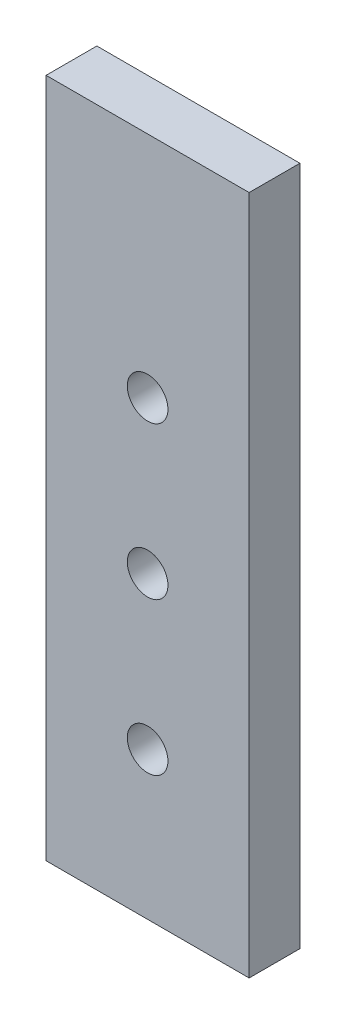
ISO-10303-21;
HEADER;
FILE_DESCRIPTION(('STEP AP214'),'2;1');
FILE_NAME('part.step','',(''),(''),'','','');
FILE_SCHEMA(('AUTOMOTIVE_DESIGN { 1 0 10303 214 1 1 1 1 }'));
ENDSEC;
DATA;
#1=APPLICATION_CONTEXT('core data for automotive mechanical design processes');
#2=APPLICATION_PROTOCOL_DEFINITION('international standard','automotive_design',2000,#1);
#3=PRODUCT_CONTEXT('',#1,'mechanical');
#4=PRODUCT('Part','Part','',(#3));
#5=PRODUCT_RELATED_PRODUCT_CATEGORY('part','',(#4));
#6=PRODUCT_DEFINITION_FORMATION('','',#4);
#7=PRODUCT_DEFINITION_CONTEXT('part definition',#1,'design');
#8=PRODUCT_DEFINITION('design','',#6,#7);
#9=PRODUCT_DEFINITION_SHAPE('','',#8);
#10=(LENGTH_UNIT() NAMED_UNIT(*) SI_UNIT(.MILLI.,.METRE.));
#11=(NAMED_UNIT(*) PLANE_ANGLE_UNIT() SI_UNIT($,.RADIAN.));
#12=(NAMED_UNIT(*) SI_UNIT($,.STERADIAN.) SOLID_ANGLE_UNIT());
#13=UNCERTAINTY_MEASURE_WITH_UNIT(LENGTH_MEASURE(1.E-05),#10,'distance_accuracy_value','');
#14=(GEOMETRIC_REPRESENTATION_CONTEXT(3) GLOBAL_UNCERTAINTY_ASSIGNED_CONTEXT((#13)) GLOBAL_UNIT_ASSIGNED_CONTEXT((#10,
#11,#12)) REPRESENTATION_CONTEXT('',''));
#15=CARTESIAN_POINT('',(0.,0.,0.));
#16=DIRECTION('',(0.,0.,1.));
#17=DIRECTION('',(1.,0.,0.));
#18=AXIS2_PLACEMENT_3D('',#15,#16,#17);
#19=CARTESIAN_POINT('',(10.,15.,5.));
#20=DIRECTION('',(-1.,0.,0.));
#21=DIRECTION('',(0.,-1.,0.));
#22=AXIS2_PLACEMENT_3D('',#19,#20,#21);
#23=PLANE('',#22);
#24=DIRECTION('',(0.,1.,0.));
#25=VECTOR('',#24,1.);
#26=CARTESIAN_POINT('',(10.,15.,0.));
#27=LINE('',#26,#25);
#28=CARTESIAN_POINT('',(10.,-22.,0.));
#29=VERTEX_POINT('',#28);
#30=CARTESIAN_POINT('',(10.,45.,0.));
#31=VERTEX_POINT('',#30);
#32=EDGE_CURVE('E56',#29,#31,#27,.T.);
#33=ORIENTED_EDGE('',*,*,#32,.T.);
#34=DIRECTION('',(0.,0.,-1.));
#35=VECTOR('',#34,1.);
#36=CARTESIAN_POINT('',(10.,45.,0.));
#37=LINE('',#36,#35);
#38=CARTESIAN_POINT('',(10.,45.,5.));
#39=VERTEX_POINT('',#38);
#40=EDGE_CURVE('E94',#39,#31,#37,.T.);
#41=ORIENTED_EDGE('',*,*,#40,.F.);
#42=DIRECTION('',(0.,1.,0.));
#43=VECTOR('',#42,1.);
#44=CARTESIAN_POINT('',(10.,15.,5.));
#45=LINE('',#44,#43);
#46=CARTESIAN_POINT('',(10.,-22.,5.));
#47=VERTEX_POINT('',#46);
#48=EDGE_CURVE('E48',#47,#39,#45,.T.);
#49=ORIENTED_EDGE('',*,*,#48,.F.);
#50=DIRECTION('',(0.,0.,1.));
#51=VECTOR('',#50,1.);
#52=CARTESIAN_POINT('',(10.,-22.,0.));
#53=LINE('',#52,#51);
#54=EDGE_CURVE('E112',#29,#47,#53,.T.);
#55=ORIENTED_EDGE('',*,*,#54,.F.);
#56=EDGE_LOOP('',(#33,#41,#49,#55));
#57=FACE_BOUND('',#56,.T.);
#58=ADVANCED_FACE('F39',(#57),#23,.F.);
#59=CARTESIAN_POINT('',(-10.,15.,5.));
#60=DIRECTION('',(1.,0.,0.));
#61=DIRECTION('',(0.,1.,0.));
#62=AXIS2_PLACEMENT_3D('',#59,#60,#61);
#63=PLANE('',#62);
#64=DIRECTION('',(0.,-1.,0.));
#65=VECTOR('',#64,1.);
#66=CARTESIAN_POINT('',(-10.,15.,0.));
#67=LINE('',#66,#65);
#68=CARTESIAN_POINT('',(-10.,45.,0.));
#69=VERTEX_POINT('',#68);
#70=CARTESIAN_POINT('',(-10.,-22.,0.));
#71=VERTEX_POINT('',#70);
#72=EDGE_CURVE('E42',#69,#71,#67,.T.);
#73=ORIENTED_EDGE('',*,*,#72,.T.);
#74=DIRECTION('',(0.,0.,-1.));
#75=VECTOR('',#74,1.);
#76=CARTESIAN_POINT('',(-10.,-22.,0.));
#77=LINE('',#76,#75);
#78=CARTESIAN_POINT('',(-10.,-22.,5.));
#79=VERTEX_POINT('',#78);
#80=EDGE_CURVE('E83',#79,#71,#77,.T.);
#81=ORIENTED_EDGE('',*,*,#80,.F.);
#82=DIRECTION('',(0.,-1.,0.));
#83=VECTOR('',#82,1.);
#84=CARTESIAN_POINT('',(-10.,15.,5.));
#85=LINE('',#84,#83);
#86=CARTESIAN_POINT('',(-10.,45.,5.));
#87=VERTEX_POINT('',#86);
#88=EDGE_CURVE('E11',#87,#79,#85,.T.);
#89=ORIENTED_EDGE('',*,*,#88,.F.);
#90=DIRECTION('',(0.,0.,1.));
#91=VECTOR('',#90,1.);
#92=CARTESIAN_POINT('',(-10.,45.,0.));
#93=LINE('',#92,#91);
#94=EDGE_CURVE('E82',#69,#87,#93,.T.);
#95=ORIENTED_EDGE('',*,*,#94,.F.);
#96=EDGE_LOOP('',(#73,#81,#89,#95));
#97=FACE_BOUND('',#96,.T.);
#98=ADVANCED_FACE('F80',(#97),#63,.F.);
#99=CARTESIAN_POINT('',(0.,0.,5.));
#100=DIRECTION('',(0.,0.,1.));
#101=DIRECTION('',(1.,0.,0.));
#102=AXIS2_PLACEMENT_3D('',#99,#100,#101);
#103=PLANE('',#102);
#104=CARTESIAN_POINT('',(0.,22.5,5.));
#105=DIRECTION('',(0.,0.,1.));
#106=DIRECTION('',(1.,0.,0.));
#107=AXIS2_PLACEMENT_3D('',#104,#105,#106);
#108=CIRCLE('',#107,2.);
#109=CARTESIAN_POINT('',(2.,22.5,5.));
#110=VERTEX_POINT('',#109);
#111=EDGE_CURVE('E100',#110,#110,#108,.T.);
#112=ORIENTED_EDGE('',*,*,#111,.F.);
#113=EDGE_LOOP('',(#112));
#114=FACE_BOUND('',#113,.T.);
#115=CARTESIAN_POINT('',(0.,7.5,5.));
#116=DIRECTION('',(0.,0.,1.));
#117=DIRECTION('',(1.,0.,0.));
#118=AXIS2_PLACEMENT_3D('',#115,#116,#117);
#119=CIRCLE('',#118,2.);
#120=CARTESIAN_POINT('',(2.,7.5,5.));
#121=VERTEX_POINT('',#120);
#122=EDGE_CURVE('E129',#121,#121,#119,.T.);
#123=ORIENTED_EDGE('',*,*,#122,.F.);
#124=EDGE_LOOP('',(#123));
#125=FACE_BOUND('',#124,.T.);
#126=CARTESIAN_POINT('',(0.,-7.5,5.));
#127=DIRECTION('',(0.,0.,1.));
#128=DIRECTION('',(1.,0.,0.));
#129=AXIS2_PLACEMENT_3D('',#126,#127,#128);
#130=CIRCLE('',#129,2.);
#131=CARTESIAN_POINT('',(2.,-7.5,5.));
#132=VERTEX_POINT('',#131);
#133=EDGE_CURVE('E124',#132,#132,#130,.T.);
#134=ORIENTED_EDGE('',*,*,#133,.F.);
#135=EDGE_LOOP('',(#134));
#136=FACE_BOUND('',#135,.T.);
#137=ORIENTED_EDGE('',*,*,#48,.T.);
#138=DIRECTION('',(1.,0.,0.));
#139=VECTOR('',#138,1.);
#140=CARTESIAN_POINT('',(-10.,45.,5.));
#141=LINE('',#140,#139);
#142=EDGE_CURVE('E88',#87,#39,#141,.T.);
#143=ORIENTED_EDGE('',*,*,#142,.F.);
#144=ORIENTED_EDGE('',*,*,#88,.T.);
#145=DIRECTION('',(-1.,0.,0.));
#146=VECTOR('',#145,1.);
#147=CARTESIAN_POINT('',(10.,-22.,5.));
#148=LINE('',#147,#146);
#149=EDGE_CURVE('E116',#47,#79,#148,.T.);
#150=ORIENTED_EDGE('',*,*,#149,.F.);
#151=EDGE_LOOP('',(#137,#143,#144,#150));
#152=FACE_BOUND('',#151,.T.);
#153=ADVANCED_FACE('F89',(#114,#125,#136,#152),#103,.T.);
#154=CARTESIAN_POINT('',(0.,0.,0.));
#155=DIRECTION('',(0.,0.,1.));
#156=DIRECTION('',(1.,0.,0.));
#157=AXIS2_PLACEMENT_3D('',#154,#155,#156);
#158=PLANE('',#157);
#159=CARTESIAN_POINT('',(0.,22.5,0.));
#160=DIRECTION('',(0.,0.,-1.));
#161=DIRECTION('',(-1.,0.,0.));
#162=AXIS2_PLACEMENT_3D('',#159,#160,#161);
#163=CIRCLE('',#162,2.);
#164=CARTESIAN_POINT('',(-2.,22.5,0.));
#165=VERTEX_POINT('',#164);
#166=EDGE_CURVE('E104',#165,#165,#163,.T.);
#167=ORIENTED_EDGE('',*,*,#166,.F.);
#168=EDGE_LOOP('',(#167));
#169=FACE_BOUND('',#168,.T.);
#170=CARTESIAN_POINT('',(0.,7.5,0.));
#171=DIRECTION('',(0.,0.,1.));
#172=DIRECTION('',(1.,0.,0.));
#173=AXIS2_PLACEMENT_3D('',#170,#171,#172);
#174=CIRCLE('',#173,2.);
#175=CARTESIAN_POINT('',(2.,7.5,0.));
#176=VERTEX_POINT('',#175);
#177=EDGE_CURVE('E125',#176,#176,#174,.T.);
#178=ORIENTED_EDGE('',*,*,#177,.T.);
#179=EDGE_LOOP('',(#178));
#180=FACE_BOUND('',#179,.T.);
#181=CARTESIAN_POINT('',(0.,-7.5,0.));
#182=DIRECTION('',(0.,0.,1.));
#183=DIRECTION('',(1.,0.,0.));
#184=AXIS2_PLACEMENT_3D('',#181,#182,#183);
#185=CIRCLE('',#184,2.);
#186=CARTESIAN_POINT('',(2.,-7.5,0.));
#187=VERTEX_POINT('',#186);
#188=EDGE_CURVE('E133',#187,#187,#185,.T.);
#189=ORIENTED_EDGE('',*,*,#188,.T.);
#190=EDGE_LOOP('',(#189));
#191=FACE_BOUND('',#190,.T.);
#192=ORIENTED_EDGE('',*,*,#32,.F.);
#193=DIRECTION('',(1.,0.,0.));
#194=VECTOR('',#193,1.);
#195=CARTESIAN_POINT('',(10.,-22.,0.));
#196=LINE('',#195,#194);
#197=EDGE_CURVE('E121',#71,#29,#196,.T.);
#198=ORIENTED_EDGE('',*,*,#197,.F.);
#199=ORIENTED_EDGE('',*,*,#72,.F.);
#200=DIRECTION('',(-1.,0.,0.));
#201=VECTOR('',#200,1.);
#202=CARTESIAN_POINT('',(-10.,45.,0.));
#203=LINE('',#202,#201);
#204=EDGE_CURVE('E98',#31,#69,#203,.T.);
#205=ORIENTED_EDGE('',*,*,#204,.F.);
#206=EDGE_LOOP('',(#192,#198,#199,#205));
#207=FACE_BOUND('',#206,.T.);
#208=ADVANCED_FACE('F145',(#169,#180,#191,#207),#158,.F.);
#209=CARTESIAN_POINT('',(0.,-7.5,0.));
#210=DIRECTION('',(0.,0.,1.));
#211=DIRECTION('',(1.,0.,0.));
#212=AXIS2_PLACEMENT_3D('',#209,#210,#211);
#213=CYLINDRICAL_SURFACE('',#212,2.);
#214=ORIENTED_EDGE('',*,*,#188,.F.);
#215=EDGE_LOOP('',(#214));
#216=FACE_BOUND('',#215,.T.);
#217=ORIENTED_EDGE('',*,*,#133,.T.);
#218=EDGE_LOOP('',(#217));
#219=FACE_BOUND('',#218,.T.);
#220=ADVANCED_FACE('F157',(#216,#219),#213,.F.);
#221=CARTESIAN_POINT('',(0.,7.5,0.));
#222=DIRECTION('',(0.,0.,1.));
#223=DIRECTION('',(1.,0.,0.));
#224=AXIS2_PLACEMENT_3D('',#221,#222,#223);
#225=CYLINDRICAL_SURFACE('',#224,2.);
#226=ORIENTED_EDGE('',*,*,#177,.F.);
#227=EDGE_LOOP('',(#226));
#228=FACE_BOUND('',#227,.T.);
#229=ORIENTED_EDGE('',*,*,#122,.T.);
#230=EDGE_LOOP('',(#229));
#231=FACE_BOUND('',#230,.T.);
#232=ADVANCED_FACE('F149',(#228,#231),#225,.F.);
#233=CARTESIAN_POINT('',(0.,-22.,0.));
#234=DIRECTION('',(0.,-1.,0.));
#235=DIRECTION('',(0.,0.,-1.));
#236=AXIS2_PLACEMENT_3D('',#233,#234,#235);
#237=PLANE('',#236);
#238=ORIENTED_EDGE('',*,*,#54,.T.);
#239=ORIENTED_EDGE('',*,*,#149,.T.);
#240=ORIENTED_EDGE('',*,*,#80,.T.);
#241=ORIENTED_EDGE('',*,*,#197,.T.);
#242=EDGE_LOOP('',(#238,#239,#240,#241));
#243=FACE_BOUND('',#242,.T.);
#244=ADVANCED_FACE('F147',(#243),#237,.T.);
#245=CARTESIAN_POINT('',(0.,45.,0.));
#246=DIRECTION('',(0.,1.,0.));
#247=DIRECTION('',(0.,0.,1.));
#248=AXIS2_PLACEMENT_3D('',#245,#246,#247);
#249=PLANE('',#248);
#250=ORIENTED_EDGE('',*,*,#94,.T.);
#251=ORIENTED_EDGE('',*,*,#142,.T.);
#252=ORIENTED_EDGE('',*,*,#40,.T.);
#253=ORIENTED_EDGE('',*,*,#204,.T.);
#254=EDGE_LOOP('',(#250,#251,#252,#253));
#255=FACE_BOUND('',#254,.T.);
#256=ADVANCED_FACE('F97',(#255),#249,.T.);
#257=CARTESIAN_POINT('',(0.,22.5,7.));
#258=DIRECTION('',(0.,0.,-1.));
#259=DIRECTION('',(-1.,0.,0.));
#260=AXIS2_PLACEMENT_3D('',#257,#258,#259);
#261=CYLINDRICAL_SURFACE('',#260,2.);
#262=ORIENTED_EDGE('',*,*,#111,.T.);
#263=EDGE_LOOP('',(#262));
#264=FACE_BOUND('',#263,.T.);
#265=ORIENTED_EDGE('',*,*,#166,.T.);
#266=EDGE_LOOP('',(#265));
#267=FACE_BOUND('',#266,.T.);
#268=ADVANCED_FACE('F155',(#264,#267),#261,.F.);
#269=CLOSED_SHELL('',(#58,#98,#153,#208,#220,#232,#244,#256,#268));
#270=MANIFOLD_SOLID_BREP('B2',#269);
#271=ADVANCED_BREP_SHAPE_REPRESENTATION('',(#18,#270),#14);
#272=SHAPE_DEFINITION_REPRESENTATION(#9,#271);
ENDSEC;
END-ISO-10303-21;
